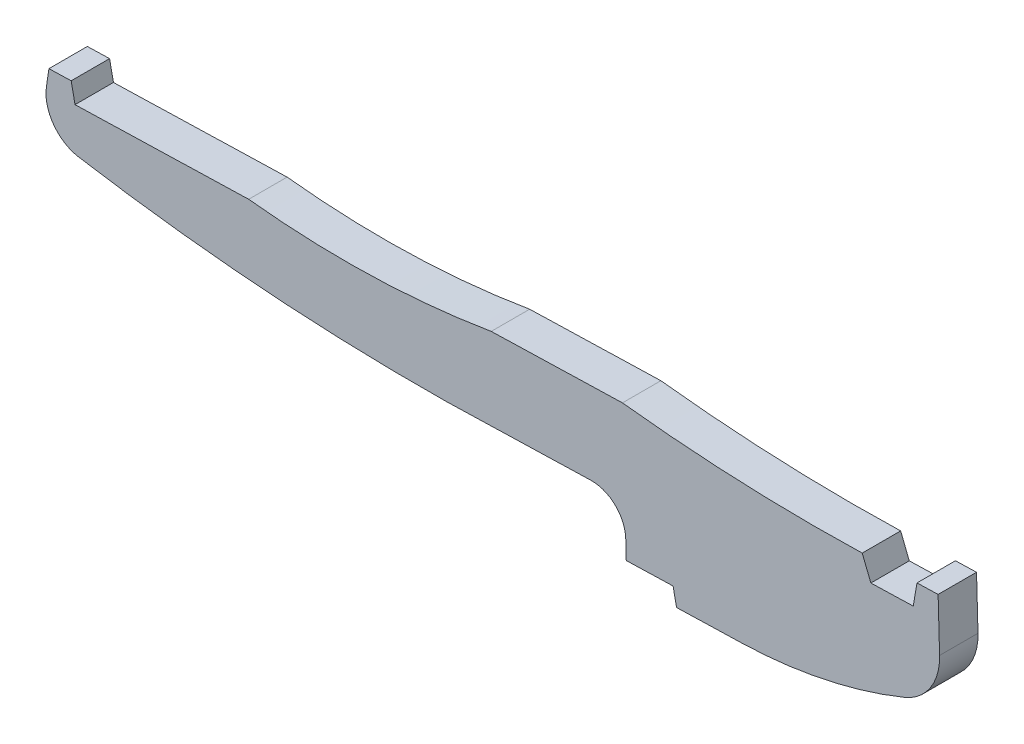
ISO-10303-21;
HEADER;
FILE_DESCRIPTION(('STEP AP214'),'2;1');
FILE_NAME('part.step','',(''),(''),'','','');
FILE_SCHEMA(('AUTOMOTIVE_DESIGN { 1 0 10303 214 1 1 1 1 }'));
ENDSEC;
DATA;
#1=APPLICATION_CONTEXT('core data for automotive mechanical design processes');
#2=APPLICATION_PROTOCOL_DEFINITION('international standard','automotive_design',2000,#1);
#3=PRODUCT_CONTEXT('',#1,'mechanical');
#4=PRODUCT('Part','Part','',(#3));
#5=PRODUCT_RELATED_PRODUCT_CATEGORY('part','',(#4));
#6=PRODUCT_DEFINITION_FORMATION('','',#4);
#7=PRODUCT_DEFINITION_CONTEXT('part definition',#1,'design');
#8=PRODUCT_DEFINITION('design','',#6,#7);
#9=PRODUCT_DEFINITION_SHAPE('','',#8);
#10=(LENGTH_UNIT() NAMED_UNIT(*) SI_UNIT(.MILLI.,.METRE.));
#11=(NAMED_UNIT(*) PLANE_ANGLE_UNIT() SI_UNIT($,.RADIAN.));
#12=(NAMED_UNIT(*) SI_UNIT($,.STERADIAN.) SOLID_ANGLE_UNIT());
#13=UNCERTAINTY_MEASURE_WITH_UNIT(LENGTH_MEASURE(1.E-05),#10,'distance_accuracy_value','');
#14=(GEOMETRIC_REPRESENTATION_CONTEXT(3) GLOBAL_UNCERTAINTY_ASSIGNED_CONTEXT((#13)) GLOBAL_UNIT_ASSIGNED_CONTEXT((#10,
#11,#12)) REPRESENTATION_CONTEXT('',''));
#15=CARTESIAN_POINT('',(0.,0.,0.));
#16=DIRECTION('',(0.,0.,1.));
#17=DIRECTION('',(1.,0.,0.));
#18=AXIS2_PLACEMENT_3D('',#15,#16,#17);
#19=CARTESIAN_POINT('',(-61.2898232129997,-19.2370589816528,6.8));
#20=DIRECTION('',(0.,0.,-1.));
#21=DIRECTION('',(-1.,0.,0.));
#22=AXIS2_PLACEMENT_3D('',#19,#20,#21);
#23=CYLINDRICAL_SURFACE('',#22,6.00000000000194);
#24=CARTESIAN_POINT('',(-61.2898232129997,-19.2370589816528,0.));
#25=DIRECTION('',(0.,0.,-1.));
#26=DIRECTION('',(1.,0.,0.));
#27=AXIS2_PLACEMENT_3D('',#24,#25,#26);
#28=CIRCLE('',#27,6.00000000000194);
#29=CARTESIAN_POINT('',(-61.45912368475,-13.239448011414,0.));
#30=VERTEX_POINT('',#29);
#31=CARTESIAN_POINT('',(-55.2922122427676,-19.0677585099014,0.));
#32=VERTEX_POINT('',#31);
#33=EDGE_CURVE('E272',#30,#32,#28,.T.);
#34=ORIENTED_EDGE('',*,*,#33,.T.);
#35=DIRECTION('',(0.,0.,-1.));
#36=VECTOR('',#35,1.);
#37=CARTESIAN_POINT('',(-55.2922122427676,-19.0677585099014,6.8));
#38=LINE('',#37,#36);
#39=CARTESIAN_POINT('',(-55.2922122427676,-19.0677585099014,6.8));
#40=VERTEX_POINT('',#39);
#41=EDGE_CURVE('E11',#40,#32,#38,.T.);
#42=ORIENTED_EDGE('',*,*,#41,.F.);
#43=CARTESIAN_POINT('',(-61.2898232129997,-19.2370589816528,6.8));
#44=DIRECTION('',(0.,0.,-1.));
#45=DIRECTION('',(1.,0.,0.));
#46=AXIS2_PLACEMENT_3D('',#43,#44,#45);
#47=CIRCLE('',#46,6.00000000000194);
#48=CARTESIAN_POINT('',(-61.45912368475,-13.239448011414,6.8));
#49=VERTEX_POINT('',#48);
#50=EDGE_CURVE('E334',#49,#40,#47,.T.);
#51=ORIENTED_EDGE('',*,*,#50,.F.);
#52=DIRECTION('',(0.,0.,-1.));
#53=VECTOR('',#52,1.);
#54=CARTESIAN_POINT('',(-61.45912368475,-13.239448011414,6.8));
#55=LINE('',#54,#53);
#56=EDGE_CURVE('E268',#49,#30,#55,.T.);
#57=ORIENTED_EDGE('',*,*,#56,.T.);
#58=EDGE_LOOP('',(#34,#42,#51,#57));
#59=FACE_BOUND('',#58,.T.);
#60=ADVANCED_FACE('F41',(#59),#23,.F.);
#61=CARTESIAN_POINT('',(-55.1978997779019,-22.4088565473677,6.8));
#62=DIRECTION('',(0.999601828372247,0.0282167452917683,0.));
#63=DIRECTION('',(-0.0282167452917683,0.999601828372247,0.));
#64=AXIS2_PLACEMENT_3D('',#61,#62,#63);
#65=PLANE('',#64);
#66=DIRECTION('',(0.0282167452917683,-0.999601828372247,0.));
#67=VECTOR('',#66,1.);
#68=CARTESIAN_POINT('',(-55.1978997779019,-22.4088565473677,0.));
#69=LINE('',#68,#67);
#70=CARTESIAN_POINT('',(-55.1978997779019,-22.4088565473677,0.));
#71=VERTEX_POINT('',#70);
#72=EDGE_CURVE('E276',#32,#71,#69,.T.);
#73=ORIENTED_EDGE('',*,*,#72,.T.);
#74=DIRECTION('',(0.,0.,-1.));
#75=VECTOR('',#74,1.);
#76=CARTESIAN_POINT('',(-55.1978997779019,-22.4088565473677,6.8));
#77=LINE('',#76,#75);
#78=CARTESIAN_POINT('',(-55.1978997779019,-22.4088565473677,6.8));
#79=VERTEX_POINT('',#78);
#80=EDGE_CURVE('E50',#79,#71,#77,.T.);
#81=ORIENTED_EDGE('',*,*,#80,.F.);
#82=DIRECTION('',(0.0282167452917683,-0.999601828372247,0.));
#83=VECTOR('',#82,1.);
#84=CARTESIAN_POINT('',(-55.1978997779019,-22.4088565473677,6.8));
#85=LINE('',#84,#83);
#86=EDGE_CURVE('E170',#40,#79,#85,.T.);
#87=ORIENTED_EDGE('',*,*,#86,.F.);
#88=ORIENTED_EDGE('',*,*,#41,.T.);
#89=EDGE_LOOP('',(#73,#81,#87,#88));
#90=FACE_BOUND('',#89,.T.);
#91=ADVANCED_FACE('F499',(#90),#65,.F.);
#92=CARTESIAN_POINT('',(-46.9099765247164,-22.1749051751369,6.8));
#93=DIRECTION('',(-0.0282167452916735,0.99960182837225,0.));
#94=DIRECTION('',(-0.99960182837225,-0.0282167452916735,0.));
#95=AXIS2_PLACEMENT_3D('',#92,#93,#94);
#96=PLANE('',#95);
#97=DIRECTION('',(0.99960182837225,0.0282167452916735,0.));
#98=VECTOR('',#97,1.);
#99=CARTESIAN_POINT('',(-46.9099765247164,-22.1749051751369,0.));
#100=LINE('',#99,#98);
#101=CARTESIAN_POINT('',(-46.9099765247164,-22.1749051751369,0.));
#102=VERTEX_POINT('',#101);
#103=EDGE_CURVE('E279',#71,#102,#100,.T.);
#104=ORIENTED_EDGE('',*,*,#103,.T.);
#105=DIRECTION('',(0.,0.,-1.));
#106=VECTOR('',#105,1.);
#107=CARTESIAN_POINT('',(-46.9099765247164,-22.1749051751369,6.8));
#108=LINE('',#107,#106);
#109=CARTESIAN_POINT('',(-46.9099765247164,-22.1749051751369,6.8));
#110=VERTEX_POINT('',#109);
#111=EDGE_CURVE('E401',#110,#102,#108,.T.);
#112=ORIENTED_EDGE('',*,*,#111,.F.);
#113=DIRECTION('',(0.99960182837225,0.0282167452916735,0.));
#114=VECTOR('',#113,1.);
#115=CARTESIAN_POINT('',(-46.9099765247164,-22.1749051751369,6.8));
#116=LINE('',#115,#114);
#117=EDGE_CURVE('E412',#79,#110,#116,.T.);
#118=ORIENTED_EDGE('',*,*,#117,.F.);
#119=ORIENTED_EDGE('',*,*,#80,.T.);
#120=EDGE_LOOP('',(#104,#112,#118,#119));
#121=FACE_BOUND('',#120,.T.);
#122=ADVANCED_FACE('F410',(#121),#96,.F.);
#123=CARTESIAN_POINT('',(-46.2965559719447,-25.1587845397603,6.8));
#124=DIRECTION('',(0.979515844108459,0.201367105408241,0.));
#125=DIRECTION('',(-0.201367105408241,0.979515844108459,0.));
#126=AXIS2_PLACEMENT_3D('',#123,#124,#125);
#127=PLANE('',#126);
#128=DIRECTION('',(0.201367105408241,-0.979515844108459,0.));
#129=VECTOR('',#128,1.);
#130=CARTESIAN_POINT('',(-46.2965559719447,-25.1587845397603,0.));
#131=LINE('',#130,#129);
#132=CARTESIAN_POINT('',(-46.2965559719447,-25.1587845397603,0.));
#133=VERTEX_POINT('',#132);
#134=EDGE_CURVE('E282',#102,#133,#131,.T.);
#135=ORIENTED_EDGE('',*,*,#134,.T.);
#136=DIRECTION('',(0.,0.,-1.));
#137=VECTOR('',#136,1.);
#138=CARTESIAN_POINT('',(-46.2965559719447,-25.1587845397603,6.8));
#139=LINE('',#138,#137);
#140=CARTESIAN_POINT('',(-46.2965559719447,-25.1587845397603,6.8));
#141=VERTEX_POINT('',#140);
#142=EDGE_CURVE('E397',#141,#133,#139,.T.);
#143=ORIENTED_EDGE('',*,*,#142,.F.);
#144=DIRECTION('',(0.201367105408241,-0.979515844108459,0.));
#145=VECTOR('',#144,1.);
#146=CARTESIAN_POINT('',(-46.2965559719447,-25.1587845397603,6.8));
#147=LINE('',#146,#145);
#148=EDGE_CURVE('E431',#110,#141,#147,.T.);
#149=ORIENTED_EDGE('',*,*,#148,.F.);
#150=ORIENTED_EDGE('',*,*,#111,.T.);
#151=EDGE_LOOP('',(#135,#143,#149,#150));
#152=FACE_BOUND('',#151,.T.);
#153=ADVANCED_FACE('F421',(#152),#127,.F.);
#154=CARTESIAN_POINT('',(-34.7870709910764,-24.8338949718227,6.8));
#155=DIRECTION('',(-0.0282167452904592,0.999601828372284,0.));
#156=DIRECTION('',(-0.999601828372284,-0.0282167452904592,0.));
#157=AXIS2_PLACEMENT_3D('',#154,#155,#156);
#158=PLANE('',#157);
#159=DIRECTION('',(0.999601828372284,0.0282167452904592,0.));
#160=VECTOR('',#159,1.);
#161=CARTESIAN_POINT('',(-34.7870709910764,-24.8338949718227,0.));
#162=LINE('',#161,#160);
#163=CARTESIAN_POINT('',(-34.7870709910764,-24.8338949718227,0.));
#164=VERTEX_POINT('',#163);
#165=EDGE_CURVE('E285',#133,#164,#162,.T.);
#166=ORIENTED_EDGE('',*,*,#165,.T.);
#167=DIRECTION('',(0.,0.,-1.));
#168=VECTOR('',#167,1.);
#169=CARTESIAN_POINT('',(-34.7870709910764,-24.8338949718227,6.8));
#170=LINE('',#169,#168);
#171=CARTESIAN_POINT('',(-34.7870709910764,-24.8338949718227,6.8));
#172=VERTEX_POINT('',#171);
#173=EDGE_CURVE('E393',#172,#164,#170,.T.);
#174=ORIENTED_EDGE('',*,*,#173,.F.);
#175=DIRECTION('',(0.999601828372284,0.0282167452904592,0.));
#176=VECTOR('',#175,1.);
#177=CARTESIAN_POINT('',(-34.7870709910764,-24.8338949718227,6.8));
#178=LINE('',#177,#176);
#179=EDGE_CURVE('E427',#141,#172,#178,.T.);
#180=ORIENTED_EDGE('',*,*,#179,.F.);
#181=ORIENTED_EDGE('',*,*,#142,.T.);
#182=EDGE_LOOP('',(#166,#174,#180,#181));
#183=FACE_BOUND('',#182,.T.);
#184=ADVANCED_FACE('F425',(#183),#158,.F.);
#185=CARTESIAN_POINT('',(-37.1187463873878,57.7676583021074,6.8));
#186=DIRECTION('',(0.,0.,-1.));
#187=DIRECTION('',(-1.,0.,0.));
#188=AXIS2_PLACEMENT_3D('',#185,#186,#187);
#189=CYLINDRICAL_SURFACE('',#188,82.6344559697685);
#190=CARTESIAN_POINT('',(-37.1187463873878,57.7676583021074,0.));
#191=DIRECTION('',(0.,0.,1.));
#192=DIRECTION('',(1.,0.,0.));
#193=AXIS2_PLACEMENT_3D('',#190,#191,#192);
#194=CIRCLE('',#193,82.6344559697685);
#195=CARTESIAN_POINT('',(-5.9656170288609,-18.7694950587962,0.));
#196=VERTEX_POINT('',#195);
#197=EDGE_CURVE('E288',#164,#196,#194,.T.);
#198=ORIENTED_EDGE('',*,*,#197,.T.);
#199=DIRECTION('',(0.,0.,-1.));
#200=VECTOR('',#199,1.);
#201=CARTESIAN_POINT('',(-5.9656170288609,-18.7694950587962,6.8));
#202=LINE('',#201,#200);
#203=CARTESIAN_POINT('',(-5.9656170288609,-18.7694950587962,6.8));
#204=VERTEX_POINT('',#203);
#205=EDGE_CURVE('E389',#204,#196,#202,.T.);
#206=ORIENTED_EDGE('',*,*,#205,.F.);
#207=CARTESIAN_POINT('',(-37.1187463873878,57.7676583021074,6.8));
#208=DIRECTION('',(0.,0.,1.));
#209=DIRECTION('',(1.,0.,0.));
#210=AXIS2_PLACEMENT_3D('',#207,#208,#209);
#211=CIRCLE('',#210,82.6344559697685);
#212=EDGE_CURVE('E430',#172,#204,#211,.T.);
#213=ORIENTED_EDGE('',*,*,#212,.F.);
#214=ORIENTED_EDGE('',*,*,#173,.T.);
#215=EDGE_LOOP('',(#198,#206,#213,#214));
#216=FACE_BOUND('',#215,.T.);
#217=ADVANCED_FACE('F512',(#216),#189,.T.);
#218=CARTESIAN_POINT('',(-9.73560970236277,-9.50735949287031,6.8));
#219=DIRECTION('',(0.,0.,-1.));
#220=DIRECTION('',(-1.,0.,0.));
#221=AXIS2_PLACEMENT_3D('',#218,#219,#220);
#222=CYLINDRICAL_SURFACE('',#221,9.99999999999226);
#223=CARTESIAN_POINT('',(-9.73560970236277,-9.50735949287031,0.));
#224=DIRECTION('',(0.,0.,1.));
#225=DIRECTION('',(1.,0.,0.));
#226=AXIS2_PLACEMENT_3D('',#223,#224,#225);
#227=CIRCLE('',#226,9.99999999999226);
#228=CARTESIAN_POINT('',(0.260408581352329,-9.22519203996589,0.));
#229=VERTEX_POINT('',#228);
#230=EDGE_CURVE('E291',#196,#229,#227,.T.);
#231=ORIENTED_EDGE('',*,*,#230,.T.);
#232=DIRECTION('',(0.,0.,-1.));
#233=VECTOR('',#232,1.);
#234=CARTESIAN_POINT('',(0.260408581352329,-9.22519203996589,6.8));
#235=LINE('',#234,#233);
#236=CARTESIAN_POINT('',(0.260408581352329,-9.22519203996589,6.8));
#237=VERTEX_POINT('',#236);
#238=EDGE_CURVE('E385',#237,#229,#235,.T.);
#239=ORIENTED_EDGE('',*,*,#238,.F.);
#240=CARTESIAN_POINT('',(-9.73560970236277,-9.50735949287031,6.8));
#241=DIRECTION('',(0.,0.,1.));
#242=DIRECTION('',(1.,0.,0.));
#243=AXIS2_PLACEMENT_3D('',#240,#241,#242);
#244=CIRCLE('',#243,9.99999999999226);
#245=EDGE_CURVE('E434',#204,#237,#244,.T.);
#246=ORIENTED_EDGE('',*,*,#245,.F.);
#247=ORIENTED_EDGE('',*,*,#205,.T.);
#248=EDGE_LOOP('',(#231,#239,#246,#247));
#249=FACE_BOUND('',#248,.T.);
#250=ADVANCED_FACE('F515',(#249),#222,.T.);
#251=CARTESIAN_POINT('',(-2.62133062974744E-13,0.,6.8));
#252=DIRECTION('',(-0.999601828372293,-0.0282167452901265,0.));
#253=DIRECTION('',(0.0282167452901266,-0.999601828372294,0.));
#254=AXIS2_PLACEMENT_3D('',#251,#252,#253);
#255=PLANE('',#254);
#256=DIRECTION('',(-0.0282167452901266,0.999601828372293,0.));
#257=VECTOR('',#256,1.);
#258=CARTESIAN_POINT('',(-2.62133062974744E-13,0.,0.));
#259=LINE('',#258,#257);
#260=CARTESIAN_POINT('',(-2.62133062974744E-13,0.,0.));
#261=VERTEX_POINT('',#260);
#262=EDGE_CURVE('E294',#229,#261,#259,.T.);
#263=ORIENTED_EDGE('',*,*,#262,.T.);
#264=DIRECTION('',(0.,0.,-1.));
#265=VECTOR('',#264,1.);
#266=CARTESIAN_POINT('',(-2.62133062974744E-13,0.,6.8));
#267=LINE('',#266,#265);
#268=CARTESIAN_POINT('',(-2.62133062974744E-13,0.,6.8));
#269=VERTEX_POINT('',#268);
#270=EDGE_CURVE('E381',#269,#261,#267,.T.);
#271=ORIENTED_EDGE('',*,*,#270,.F.);
#272=DIRECTION('',(-0.0282167452901266,0.999601828372293,0.));
#273=VECTOR('',#272,1.);
#274=CARTESIAN_POINT('',(-2.62133062974744E-13,0.,6.8));
#275=LINE('',#274,#273);
#276=EDGE_CURVE('E442',#237,#269,#275,.T.);
#277=ORIENTED_EDGE('',*,*,#276,.F.);
#278=ORIENTED_EDGE('',*,*,#238,.T.);
#279=EDGE_LOOP('',(#263,#271,#277,#278));
#280=FACE_BOUND('',#279,.T.);
#281=ADVANCED_FACE('F519',(#280),#255,.F.);
#282=CARTESIAN_POINT('',(-3.73655335163197,-0.105475371486204,6.8));
#283=DIRECTION('',(0.0282167452900974,-0.999601828372294,0.));
#284=DIRECTION('',(0.999601828372294,0.0282167452900974,0.));
#285=AXIS2_PLACEMENT_3D('',#282,#283,#284);
#286=PLANE('',#285);
#287=DIRECTION('',(-0.999601828372294,-0.0282167452900974,0.));
#288=VECTOR('',#287,1.);
#289=CARTESIAN_POINT('',(-3.73655335163197,-0.105475371486204,0.));
#290=LINE('',#289,#288);
#291=CARTESIAN_POINT('',(-3.73655335163197,-0.105475371486204,0.));
#292=VERTEX_POINT('',#291);
#293=EDGE_CURVE('E297',#261,#292,#290,.T.);
#294=ORIENTED_EDGE('',*,*,#293,.T.);
#295=DIRECTION('',(0.,0.,-1.));
#296=VECTOR('',#295,1.);
#297=CARTESIAN_POINT('',(-3.73655335163197,-0.105475371486204,6.8));
#298=LINE('',#297,#296);
#299=CARTESIAN_POINT('',(-3.73655335163197,-0.105475371486204,6.8));
#300=VERTEX_POINT('',#299);
#301=EDGE_CURVE('E377',#300,#292,#298,.T.);
#302=ORIENTED_EDGE('',*,*,#301,.F.);
#303=DIRECTION('',(-0.999601828372294,-0.0282167452900974,0.));
#304=VECTOR('',#303,1.);
#305=CARTESIAN_POINT('',(-3.73655335163197,-0.105475371486204,6.8));
#306=LINE('',#305,#304);
#307=EDGE_CURVE('E445',#269,#300,#306,.T.);
#308=ORIENTED_EDGE('',*,*,#307,.F.);
#309=ORIENTED_EDGE('',*,*,#270,.T.);
#310=EDGE_LOOP('',(#294,#302,#308,#309));
#311=FACE_BOUND('',#310,.T.);
#312=ADVANCED_FACE('F523',(#311),#286,.F.);
#313=CARTESIAN_POINT('',(-4.4060557155227,-3.99410363196135,6.8));
#314=DIRECTION('',(0.98550043322748,-0.169672909176593,0.));
#315=DIRECTION('',(0.169672909176593,0.985500433227481,0.));
#316=AXIS2_PLACEMENT_3D('',#313,#314,#315);
#317=PLANE('',#316);
#318=DIRECTION('',(-0.169672909176593,-0.98550043322748,0.));
#319=VECTOR('',#318,1.);
#320=CARTESIAN_POINT('',(-4.4060557155227,-3.99410363196135,0.));
#321=LINE('',#320,#319);
#322=CARTESIAN_POINT('',(-4.4060557155227,-3.99410363196135,0.));
#323=VERTEX_POINT('',#322);
#324=EDGE_CURVE('E300',#292,#323,#321,.T.);
#325=ORIENTED_EDGE('',*,*,#324,.T.);
#326=DIRECTION('',(0.,0.,-1.));
#327=VECTOR('',#326,1.);
#328=CARTESIAN_POINT('',(-4.4060557155227,-3.99410363196135,6.8));
#329=LINE('',#328,#327);
#330=CARTESIAN_POINT('',(-4.4060557155227,-3.99410363196135,6.8));
#331=VERTEX_POINT('',#330);
#332=EDGE_CURVE('E373',#331,#323,#329,.T.);
#333=ORIENTED_EDGE('',*,*,#332,.F.);
#334=DIRECTION('',(-0.169672909176593,-0.98550043322748,0.));
#335=VECTOR('',#334,1.);
#336=CARTESIAN_POINT('',(-4.4060557155227,-3.99410363196135,6.8));
#337=LINE('',#336,#335);
#338=EDGE_CURVE('E448',#300,#331,#337,.T.);
#339=ORIENTED_EDGE('',*,*,#338,.F.);
#340=ORIENTED_EDGE('',*,*,#301,.T.);
#341=EDGE_LOOP('',(#325,#333,#339,#340));
#342=FACE_BOUND('',#341,.T.);
#343=ADVANCED_FACE('F527',(#342),#317,.F.);
#344=CARTESIAN_POINT('',(-11.9030694284909,-4.20572922157118,6.8));
#345=DIRECTION('',(0.0282167452806554,-0.999601828372561,0.));
#346=DIRECTION('',(0.999601828372561,0.0282167452806554,0.));
#347=AXIS2_PLACEMENT_3D('',#344,#345,#346);
#348=PLANE('',#347);
#349=DIRECTION('',(-0.999601828372561,-0.0282167452806554,0.));
#350=VECTOR('',#349,1.);
#351=CARTESIAN_POINT('',(-11.9030694284909,-4.20572922157118,0.));
#352=LINE('',#351,#350);
#353=CARTESIAN_POINT('',(-11.9030694284909,-4.20572922157118,0.));
#354=VERTEX_POINT('',#353);
#355=EDGE_CURVE('E303',#323,#354,#352,.T.);
#356=ORIENTED_EDGE('',*,*,#355,.T.);
#357=DIRECTION('',(0.,0.,-1.));
#358=VECTOR('',#357,1.);
#359=CARTESIAN_POINT('',(-11.9030694284909,-4.20572922157118,6.8));
#360=LINE('',#359,#358);
#361=CARTESIAN_POINT('',(-11.9030694284909,-4.20572922157118,6.8));
#362=VERTEX_POINT('',#361);
#363=EDGE_CURVE('E369',#362,#354,#360,.T.);
#364=ORIENTED_EDGE('',*,*,#363,.F.);
#365=DIRECTION('',(-0.999601828372561,-0.0282167452806554,0.));
#366=VECTOR('',#365,1.);
#367=CARTESIAN_POINT('',(-11.9030694284909,-4.20572922157118,6.8));
#368=LINE('',#367,#366);
#369=EDGE_CURVE('E451',#331,#362,#368,.T.);
#370=ORIENTED_EDGE('',*,*,#369,.F.);
#371=ORIENTED_EDGE('',*,*,#332,.T.);
#372=EDGE_LOOP('',(#356,#364,#370,#371));
#373=FACE_BOUND('',#372,.T.);
#374=ADVANCED_FACE('F531',(#373),#348,.F.);
#375=CARTESIAN_POINT('',(-13.4323106293656,-0.379167061252225,6.8));
#376=DIRECTION('',(-0.928592429824842,-0.371101198154891,0.));
#377=DIRECTION('',(0.371101198154891,-0.928592429824842,0.));
#378=AXIS2_PLACEMENT_3D('',#375,#376,#377);
#379=PLANE('',#378);
#380=DIRECTION('',(-0.371101198154891,0.928592429824842,0.));
#381=VECTOR('',#380,1.);
#382=CARTESIAN_POINT('',(-13.4323106293656,-0.379167061252225,0.));
#383=LINE('',#382,#381);
#384=CARTESIAN_POINT('',(-13.4323106293656,-0.379167061252225,0.));
#385=VERTEX_POINT('',#384);
#386=EDGE_CURVE('E306',#354,#385,#383,.T.);
#387=ORIENTED_EDGE('',*,*,#386,.T.);
#388=DIRECTION('',(0.,0.,-1.));
#389=VECTOR('',#388,1.);
#390=CARTESIAN_POINT('',(-13.4323106293656,-0.379167061252225,6.8));
#391=LINE('',#390,#389);
#392=CARTESIAN_POINT('',(-13.4323106293656,-0.379167061252225,6.8));
#393=VERTEX_POINT('',#392);
#394=EDGE_CURVE('E365',#393,#385,#391,.T.);
#395=ORIENTED_EDGE('',*,*,#394,.F.);
#396=DIRECTION('',(-0.371101198154891,0.928592429824842,0.));
#397=VECTOR('',#396,1.);
#398=CARTESIAN_POINT('',(-13.4323106293656,-0.379167061252225,6.8));
#399=LINE('',#398,#397);
#400=EDGE_CURVE('E454',#362,#393,#399,.T.);
#401=ORIENTED_EDGE('',*,*,#400,.F.);
#402=ORIENTED_EDGE('',*,*,#363,.T.);
#403=EDGE_LOOP('',(#387,#395,#401,#402));
#404=FACE_BOUND('',#403,.T.);
#405=ADVANCED_FACE('F535',(#404),#379,.F.);
#406=CARTESIAN_POINT('',(-21.9173907409701,300.211900627323,6.8));
#407=DIRECTION('',(0.,0.,-1.));
#408=DIRECTION('',(-1.,0.,0.));
#409=AXIS2_PLACEMENT_3D('',#406,#407,#408);
#410=CYLINDRICAL_SURFACE('',#409,300.710802198155);
#411=CARTESIAN_POINT('',(-21.9173907409701,300.211900627323,0.));
#412=DIRECTION('',(0.,0.,-1.));
#413=DIRECTION('',(1.,0.,0.));
#414=AXIS2_PLACEMENT_3D('',#411,#412,#413);
#415=CIRCLE('',#414,300.710802198155);
#416=CARTESIAN_POINT('',(-55.8706555212621,1.4240789721936,0.));
#417=VERTEX_POINT('',#416);
#418=EDGE_CURVE('E309',#385,#417,#415,.T.);
#419=ORIENTED_EDGE('',*,*,#418,.T.);
#420=DIRECTION('',(0.,0.,-1.));
#421=VECTOR('',#420,1.);
#422=CARTESIAN_POINT('',(-55.8706555212621,1.4240789721936,6.8));
#423=LINE('',#422,#421);
#424=CARTESIAN_POINT('',(-55.8706555212621,1.4240789721936,6.8));
#425=VERTEX_POINT('',#424);
#426=EDGE_CURVE('E361',#425,#417,#423,.T.);
#427=ORIENTED_EDGE('',*,*,#426,.F.);
#428=CARTESIAN_POINT('',(-21.9173907409701,300.211900627323,6.8));
#429=DIRECTION('',(0.,0.,-1.));
#430=DIRECTION('',(1.,0.,0.));
#431=AXIS2_PLACEMENT_3D('',#428,#429,#430);
#432=CIRCLE('',#431,300.710802198155);
#433=EDGE_CURVE('E457',#393,#425,#432,.T.);
#434=ORIENTED_EDGE('',*,*,#433,.F.);
#435=ORIENTED_EDGE('',*,*,#394,.T.);
#436=EDGE_LOOP('',(#419,#427,#434,#435));
#437=FACE_BOUND('',#436,.T.);
#438=ADVANCED_FACE('F539',(#437),#410,.F.);
#439=CARTESIAN_POINT('',(-79.0982507347868,0.768410765967434,6.8));
#440=DIRECTION('',(0.0282167452861209,-0.999601828372407,0.));
#441=DIRECTION('',(0.999601828372407,0.0282167452861209,0.));
#442=AXIS2_PLACEMENT_3D('',#439,#440,#441);
#443=PLANE('',#442);
#444=DIRECTION('',(-0.999601828372407,-0.0282167452861209,0.));
#445=VECTOR('',#444,1.);
#446=CARTESIAN_POINT('',(-79.0982507347868,0.768410765967434,0.));
#447=LINE('',#446,#445);
#448=CARTESIAN_POINT('',(-79.0982507347868,0.768410765967434,0.));
#449=VERTEX_POINT('',#448);
#450=EDGE_CURVE('E312',#417,#449,#447,.T.);
#451=ORIENTED_EDGE('',*,*,#450,.T.);
#452=DIRECTION('',(0.,0.,-1.));
#453=VECTOR('',#452,1.);
#454=CARTESIAN_POINT('',(-79.0982507347868,0.768410765967434,6.8));
#455=LINE('',#454,#453);
#456=CARTESIAN_POINT('',(-79.0982507347868,0.768410765967434,6.8));
#457=VERTEX_POINT('',#456);
#458=EDGE_CURVE('E357',#457,#449,#455,.T.);
#459=ORIENTED_EDGE('',*,*,#458,.F.);
#460=DIRECTION('',(-0.999601828372407,-0.0282167452861209,0.));
#461=VECTOR('',#460,1.);
#462=CARTESIAN_POINT('',(-79.0982507347868,0.768410765967434,6.8));
#463=LINE('',#462,#461);
#464=EDGE_CURVE('E460',#425,#457,#463,.T.);
#465=ORIENTED_EDGE('',*,*,#464,.F.);
#466=ORIENTED_EDGE('',*,*,#426,.T.);
#467=EDGE_LOOP('',(#451,#459,#465,#466));
#468=FACE_BOUND('',#467,.T.);
#469=ADVANCED_FACE('F543',(#468),#443,.F.);
#470=CARTESIAN_POINT('',(-104.91462496914,154.316203359426,6.8));
#471=DIRECTION('',(0.,0.,-1.));
#472=DIRECTION('',(-1.,0.,0.));
#473=AXIS2_PLACEMENT_3D('',#470,#471,#472);
#474=CYLINDRICAL_SURFACE('',#473,155.702953693666);
#475=CARTESIAN_POINT('',(-104.91462496914,154.316203359426,0.));
#476=DIRECTION('',(0.,0.,-1.));
#477=DIRECTION('',(1.,0.,0.));
#478=AXIS2_PLACEMENT_3D('',#475,#476,#477);
#479=CIRCLE('',#478,155.702953693666);
#480=CARTESIAN_POINT('',(-122.028102344561,-0.443412435693097,0.));
#481=VERTEX_POINT('',#480);
#482=EDGE_CURVE('E315',#449,#481,#479,.T.);
#483=ORIENTED_EDGE('',*,*,#482,.T.);
#484=DIRECTION('',(0.,0.,-1.));
#485=VECTOR('',#484,1.);
#486=CARTESIAN_POINT('',(-122.028102344561,-0.443412435693097,6.8));
#487=LINE('',#486,#485);
#488=CARTESIAN_POINT('',(-122.028102344561,-0.443412435693097,6.8));
#489=VERTEX_POINT('',#488);
#490=EDGE_CURVE('E353',#489,#481,#487,.T.);
#491=ORIENTED_EDGE('',*,*,#490,.F.);
#492=CARTESIAN_POINT('',(-104.91462496914,154.316203359426,6.8));
#493=DIRECTION('',(0.,0.,-1.));
#494=DIRECTION('',(1.,0.,0.));
#495=AXIS2_PLACEMENT_3D('',#492,#493,#494);
#496=CIRCLE('',#495,155.702953693666);
#497=EDGE_CURVE('E463',#457,#489,#496,.T.);
#498=ORIENTED_EDGE('',*,*,#497,.F.);
#499=ORIENTED_EDGE('',*,*,#458,.T.);
#500=EDGE_LOOP('',(#483,#491,#498,#499));
#501=FACE_BOUND('',#500,.T.);
#502=ADVANCED_FACE('F547',(#501),#474,.F.);
#503=CARTESIAN_POINT('',(-152.767576006945,-1.31112583310975,6.8));
#504=DIRECTION('',(0.0282167452861209,-0.999601828372407,0.));
#505=DIRECTION('',(0.999601828372407,0.0282167452861209,0.));
#506=AXIS2_PLACEMENT_3D('',#503,#504,#505);
#507=PLANE('',#506);
#508=DIRECTION('',(-0.999601828372407,-0.0282167452861209,0.));
#509=VECTOR('',#508,1.);
#510=CARTESIAN_POINT('',(-152.767576006945,-1.31112583310975,0.));
#511=LINE('',#510,#509);
#512=CARTESIAN_POINT('',(-152.767576006945,-1.31112583310975,0.));
#513=VERTEX_POINT('',#512);
#514=EDGE_CURVE('E318',#481,#513,#511,.T.);
#515=ORIENTED_EDGE('',*,*,#514,.T.);
#516=DIRECTION('',(0.,0.,-1.));
#517=VECTOR('',#516,1.);
#518=CARTESIAN_POINT('',(-152.767576006945,-1.31112583310975,6.8));
#519=LINE('',#518,#517);
#520=CARTESIAN_POINT('',(-152.767576006945,-1.31112583310975,6.8));
#521=VERTEX_POINT('',#520);
#522=EDGE_CURVE('E349',#521,#513,#519,.T.);
#523=ORIENTED_EDGE('',*,*,#522,.F.);
#524=DIRECTION('',(-0.999601828372407,-0.0282167452861209,0.));
#525=VECTOR('',#524,1.);
#526=CARTESIAN_POINT('',(-152.767576006945,-1.31112583310975,6.8));
#527=LINE('',#526,#525);
#528=EDGE_CURVE('E466',#489,#521,#527,.T.);
#529=ORIENTED_EDGE('',*,*,#528,.F.);
#530=ORIENTED_EDGE('',*,*,#490,.T.);
#531=EDGE_LOOP('',(#515,#523,#529,#530));
#532=FACE_BOUND('',#531,.T.);
#533=ADVANCED_FACE('F551',(#532),#507,.F.);
#534=CARTESIAN_POINT('',(-153.450231486003,2.0095349875542,6.8));
#535=DIRECTION('',(-0.979515844090378,-0.201367105496191,0.));
#536=DIRECTION('',(0.201367105496191,-0.979515844090378,0.));
#537=AXIS2_PLACEMENT_3D('',#534,#535,#536);
#538=PLANE('',#537);
#539=DIRECTION('',(-0.201367105496191,0.979515844090378,0.));
#540=VECTOR('',#539,1.);
#541=CARTESIAN_POINT('',(-153.450231486003,2.0095349875542,0.));
#542=LINE('',#541,#540);
#543=CARTESIAN_POINT('',(-153.450231486003,2.0095349875542,0.));
#544=VERTEX_POINT('',#543);
#545=EDGE_CURVE('E321',#513,#544,#542,.T.);
#546=ORIENTED_EDGE('',*,*,#545,.T.);
#547=DIRECTION('',(0.,0.,-1.));
#548=VECTOR('',#547,1.);
#549=CARTESIAN_POINT('',(-153.450231486003,2.0095349875542,6.8));
#550=LINE('',#549,#548);
#551=CARTESIAN_POINT('',(-153.450231486003,2.0095349875542,6.8));
#552=VERTEX_POINT('',#551);
#553=EDGE_CURVE('E345',#552,#544,#550,.T.);
#554=ORIENTED_EDGE('',*,*,#553,.F.);
#555=DIRECTION('',(-0.201367105496191,0.979515844090378,0.));
#556=VECTOR('',#555,1.);
#557=CARTESIAN_POINT('',(-153.450231486003,2.0095349875542,6.8));
#558=LINE('',#557,#556);
#559=EDGE_CURVE('E469',#521,#552,#558,.T.);
#560=ORIENTED_EDGE('',*,*,#559,.F.);
#561=ORIENTED_EDGE('',*,*,#522,.T.);
#562=EDGE_LOOP('',(#546,#554,#560,#561));
#563=FACE_BOUND('',#562,.T.);
#564=ADVANCED_FACE('F555',(#563),#538,.F.);
#565=CARTESIAN_POINT('',(-157.390699993582,1.89830350129465,6.8));
#566=DIRECTION('',(0.0282167455019818,-0.999601828366313,0.));
#567=DIRECTION('',(0.999601828366313,0.0282167455019818,0.));
#568=AXIS2_PLACEMENT_3D('',#565,#566,#567);
#569=PLANE('',#568);
#570=DIRECTION('',(-0.999601828366313,-0.0282167455019818,0.));
#571=VECTOR('',#570,1.);
#572=CARTESIAN_POINT('',(-157.390699993582,1.89830350129465,0.));
#573=LINE('',#572,#571);
#574=CARTESIAN_POINT('',(-157.390699993582,1.89830350129465,0.));
#575=VERTEX_POINT('',#574);
#576=EDGE_CURVE('E324',#544,#575,#573,.T.);
#577=ORIENTED_EDGE('',*,*,#576,.T.);
#578=DIRECTION('',(0.,0.,-1.));
#579=VECTOR('',#578,1.);
#580=CARTESIAN_POINT('',(-157.390699993582,1.89830350129465,6.8));
#581=LINE('',#580,#579);
#582=CARTESIAN_POINT('',(-157.390699993582,1.89830350129465,6.8));
#583=VERTEX_POINT('',#582);
#584=EDGE_CURVE('E341',#583,#575,#581,.T.);
#585=ORIENTED_EDGE('',*,*,#584,.F.);
#586=DIRECTION('',(-0.999601828366313,-0.0282167455019818,0.));
#587=VECTOR('',#586,1.);
#588=CARTESIAN_POINT('',(-157.390699993582,1.89830350129465,6.8));
#589=LINE('',#588,#587);
#590=EDGE_CURVE('E472',#552,#583,#589,.T.);
#591=ORIENTED_EDGE('',*,*,#590,.F.);
#592=ORIENTED_EDGE('',*,*,#553,.T.);
#593=EDGE_LOOP('',(#577,#585,#591,#592));
#594=FACE_BOUND('',#593,.T.);
#595=ADVANCED_FACE('F480',(#594),#569,.F.);
#596=CARTESIAN_POINT('',(-157.834820074705,-1.11542810432885,6.8));
#597=DIRECTION('',(0.989315416902209,-0.14579096638547,0.));
#598=DIRECTION('',(0.14579096638547,0.989315416902209,0.));
#599=AXIS2_PLACEMENT_3D('',#596,#597,#598);
#600=PLANE('',#599);
#601=DIRECTION('',(-0.14579096638547,-0.989315416902209,0.));
#602=VECTOR('',#601,1.);
#603=CARTESIAN_POINT('',(-157.834820074705,-1.11542810432885,0.));
#604=LINE('',#603,#602);
#605=CARTESIAN_POINT('',(-157.834820074705,-1.11542810432885,0.));
#606=VERTEX_POINT('',#605);
#607=EDGE_CURVE('E327',#575,#606,#604,.T.);
#608=ORIENTED_EDGE('',*,*,#607,.T.);
#609=DIRECTION('',(0.,0.,-1.));
#610=VECTOR('',#609,1.);
#611=CARTESIAN_POINT('',(-157.834820074705,-1.11542810432885,6.8));
#612=LINE('',#611,#610);
#613=CARTESIAN_POINT('',(-157.834820074705,-1.11542810432885,6.8));
#614=VERTEX_POINT('',#613);
#615=EDGE_CURVE('E259',#614,#606,#612,.T.);
#616=ORIENTED_EDGE('',*,*,#615,.F.);
#617=DIRECTION('',(-0.14579096638547,-0.989315416902209,0.));
#618=VECTOR('',#617,1.);
#619=CARTESIAN_POINT('',(-157.834820074705,-1.11542810432885,6.8));
#620=LINE('',#619,#618);
#621=EDGE_CURVE('E248',#583,#614,#620,.T.);
#622=ORIENTED_EDGE('',*,*,#621,.F.);
#623=ORIENTED_EDGE('',*,*,#584,.T.);
#624=EDGE_LOOP('',(#608,#616,#622,#623));
#625=FACE_BOUND('',#624,.T.);
#626=ADVANCED_FACE('F484',(#625),#600,.F.);
#627=CARTESIAN_POINT('',(-150.909612156395,-2.13596486902597,6.8));
#628=DIRECTION('',(0.,0.,-1.));
#629=DIRECTION('',(-1.,0.,0.));
#630=AXIS2_PLACEMENT_3D('',#627,#628,#629);
#631=CYLINDRICAL_SURFACE('',#630,6.99999999999081);
#632=CARTESIAN_POINT('',(-150.909612156395,-2.13596486902597,0.));
#633=DIRECTION('',(0.,0.,1.));
#634=DIRECTION('',(1.,0.,0.));
#635=AXIS2_PLACEMENT_3D('',#632,#633,#634);
#636=CIRCLE('',#635,6.99999999999081);
#637=CARTESIAN_POINT('',(-152.397282865835,-8.97605520908331,0.));
#638=VERTEX_POINT('',#637);
#639=EDGE_CURVE('E257',#606,#638,#636,.T.);
#640=ORIENTED_EDGE('',*,*,#639,.T.);
#641=DIRECTION('',(0.,0.,-1.));
#642=VECTOR('',#641,1.);
#643=CARTESIAN_POINT('',(-152.397282865835,-8.97605520908331,6.8));
#644=LINE('',#643,#642);
#645=CARTESIAN_POINT('',(-152.397282865835,-8.97605520908331,6.8));
#646=VERTEX_POINT('',#645);
#647=EDGE_CURVE('E254',#646,#638,#644,.T.);
#648=ORIENTED_EDGE('',*,*,#647,.F.);
#649=CARTESIAN_POINT('',(-150.909612156395,-2.13596486902597,6.8));
#650=DIRECTION('',(0.,0.,1.));
#651=DIRECTION('',(1.,0.,0.));
#652=AXIS2_PLACEMENT_3D('',#649,#650,#651);
#653=CIRCLE('',#652,6.99999999999081);
#654=EDGE_CURVE('E242',#614,#646,#653,.T.);
#655=ORIENTED_EDGE('',*,*,#654,.F.);
#656=ORIENTED_EDGE('',*,*,#615,.T.);
#657=EDGE_LOOP('',(#640,#648,#655,#656));
#658=FACE_BOUND('',#657,.T.);
#659=ADVANCED_FACE('F255',(#658),#631,.T.);
#660=CARTESIAN_POINT('',(-91.4577880823773,359.123139639301,6.8));
#661=DIRECTION('',(0.,0.,-1.));
#662=DIRECTION('',(-1.,0.,0.));
#663=AXIS2_PLACEMENT_3D('',#660,#661,#662);
#664=CYLINDRICAL_SURFACE('',#663,373.109419972867);
#665=CARTESIAN_POINT('',(-91.4577880823773,359.123139639301,0.));
#666=DIRECTION('',(0.,0.,1.));
#667=DIRECTION('',(1.,0.,0.));
#668=AXIS2_PLACEMENT_3D('',#665,#666,#667);
#669=CIRCLE('',#668,373.109419972867);
#670=CARTESIAN_POINT('',(-86.9527514832853,-13.9590817512796,0.));
#671=VERTEX_POINT('',#670);
#672=EDGE_CURVE('E154',#638,#671,#669,.T.);
#673=ORIENTED_EDGE('',*,*,#672,.T.);
#674=DIRECTION('',(0.,0.,-1.));
#675=VECTOR('',#674,1.);
#676=CARTESIAN_POINT('',(-86.9527514832853,-13.9590817512796,6.8));
#677=LINE('',#676,#675);
#678=CARTESIAN_POINT('',(-86.9527514832853,-13.9590817512796,6.8));
#679=VERTEX_POINT('',#678);
#680=EDGE_CURVE('E260',#679,#671,#677,.T.);
#681=ORIENTED_EDGE('',*,*,#680,.F.);
#682=CARTESIAN_POINT('',(-91.4577880823773,359.123139639301,6.8));
#683=DIRECTION('',(0.,0.,1.));
#684=DIRECTION('',(1.,0.,0.));
#685=AXIS2_PLACEMENT_3D('',#682,#683,#684);
#686=CIRCLE('',#685,373.109419972867);
#687=EDGE_CURVE('E246',#646,#679,#686,.T.);
#688=ORIENTED_EDGE('',*,*,#687,.F.);
#689=ORIENTED_EDGE('',*,*,#647,.T.);
#690=EDGE_LOOP('',(#673,#681,#688,#689));
#691=FACE_BOUND('',#690,.T.);
#692=ADVANCED_FACE('F262',(#691),#664,.T.);
#693=CARTESIAN_POINT('',(-61.45912368475,-13.239448011414,6.8));
#694=DIRECTION('',(-0.0282167452907311,0.999601828372276,0.));
#695=DIRECTION('',(-0.999601828372276,-0.0282167452907311,0.));
#696=AXIS2_PLACEMENT_3D('',#693,#694,#695);
#697=PLANE('',#696);
#698=DIRECTION('',(0.999601828372277,0.0282167452907311,0.));
#699=VECTOR('',#698,1.);
#700=CARTESIAN_POINT('',(-61.45912368475,-13.239448011414,0.));
#701=LINE('',#700,#699);
#702=EDGE_CURVE('E160',#671,#30,#701,.T.);
#703=ORIENTED_EDGE('',*,*,#702,.T.);
#704=ORIENTED_EDGE('',*,*,#56,.F.);
#705=DIRECTION('',(0.999601828372277,0.0282167452907311,0.));
#706=VECTOR('',#705,1.);
#707=CARTESIAN_POINT('',(-61.45912368475,-13.239448011414,6.8));
#708=LINE('',#707,#706);
#709=EDGE_CURVE('E61',#679,#49,#708,.T.);
#710=ORIENTED_EDGE('',*,*,#709,.F.);
#711=ORIENTED_EDGE('',*,*,#680,.T.);
#712=EDGE_LOOP('',(#703,#704,#710,#711));
#713=FACE_BOUND('',#712,.T.);
#714=ADVANCED_FACE('F488',(#713),#697,.F.);
#715=CARTESIAN_POINT('',(-61.2898232129997,-19.2370589816528,6.8));
#716=DIRECTION('',(0.,0.,1.));
#717=DIRECTION('',(1.,0.,0.));
#718=AXIS2_PLACEMENT_3D('',#715,#716,#717);
#719=PLANE('',#718);
#720=ORIENTED_EDGE('',*,*,#50,.T.);
#721=ORIENTED_EDGE('',*,*,#86,.T.);
#722=ORIENTED_EDGE('',*,*,#117,.T.);
#723=ORIENTED_EDGE('',*,*,#148,.T.);
#724=ORIENTED_EDGE('',*,*,#179,.T.);
#725=ORIENTED_EDGE('',*,*,#212,.T.);
#726=ORIENTED_EDGE('',*,*,#245,.T.);
#727=ORIENTED_EDGE('',*,*,#276,.T.);
#728=ORIENTED_EDGE('',*,*,#307,.T.);
#729=ORIENTED_EDGE('',*,*,#338,.T.);
#730=ORIENTED_EDGE('',*,*,#369,.T.);
#731=ORIENTED_EDGE('',*,*,#400,.T.);
#732=ORIENTED_EDGE('',*,*,#433,.T.);
#733=ORIENTED_EDGE('',*,*,#464,.T.);
#734=ORIENTED_EDGE('',*,*,#497,.T.);
#735=ORIENTED_EDGE('',*,*,#528,.T.);
#736=ORIENTED_EDGE('',*,*,#559,.T.);
#737=ORIENTED_EDGE('',*,*,#590,.T.);
#738=ORIENTED_EDGE('',*,*,#621,.T.);
#739=ORIENTED_EDGE('',*,*,#654,.T.);
#740=ORIENTED_EDGE('',*,*,#687,.T.);
#741=ORIENTED_EDGE('',*,*,#709,.T.);
#742=EDGE_LOOP('',(#720,#721,#722,#723,#724,#725,#726,#727,#728,#729,#730,#731,#732,#733,#734,
#735,#736,#737,#738,#739,#740,#741));
#743=FACE_BOUND('',#742,.T.);
#744=ADVANCED_FACE('F244',(#743),#719,.T.);
#745=CARTESIAN_POINT('',(-61.2898232129997,-19.2370589816528,0.));
#746=DIRECTION('',(0.,0.,1.));
#747=DIRECTION('',(1.,0.,0.));
#748=AXIS2_PLACEMENT_3D('',#745,#746,#747);
#749=PLANE('',#748);
#750=ORIENTED_EDGE('',*,*,#33,.F.);
#751=ORIENTED_EDGE('',*,*,#702,.F.);
#752=ORIENTED_EDGE('',*,*,#672,.F.);
#753=ORIENTED_EDGE('',*,*,#639,.F.);
#754=ORIENTED_EDGE('',*,*,#607,.F.);
#755=ORIENTED_EDGE('',*,*,#576,.F.);
#756=ORIENTED_EDGE('',*,*,#545,.F.);
#757=ORIENTED_EDGE('',*,*,#514,.F.);
#758=ORIENTED_EDGE('',*,*,#482,.F.);
#759=ORIENTED_EDGE('',*,*,#450,.F.);
#760=ORIENTED_EDGE('',*,*,#418,.F.);
#761=ORIENTED_EDGE('',*,*,#386,.F.);
#762=ORIENTED_EDGE('',*,*,#355,.F.);
#763=ORIENTED_EDGE('',*,*,#324,.F.);
#764=ORIENTED_EDGE('',*,*,#293,.F.);
#765=ORIENTED_EDGE('',*,*,#262,.F.);
#766=ORIENTED_EDGE('',*,*,#230,.F.);
#767=ORIENTED_EDGE('',*,*,#197,.F.);
#768=ORIENTED_EDGE('',*,*,#165,.F.);
#769=ORIENTED_EDGE('',*,*,#134,.F.);
#770=ORIENTED_EDGE('',*,*,#103,.F.);
#771=ORIENTED_EDGE('',*,*,#72,.F.);
#772=EDGE_LOOP('',(#750,#751,#752,#753,#754,#755,#756,#757,#758,#759,#760,#761,#762,#763,#764,
#765,#766,#767,#768,#769,#770,#771));
#773=FACE_BOUND('',#772,.T.);
#774=ADVANCED_FACE('F416',(#773),#749,.F.);
#775=CLOSED_SHELL('',(#60,#91,#122,#153,#184,#217,#250,#281,#312,#343,#374,#405,#438,#469,#502,
#533,#564,#595,#626,#659,#692,#714,#744,#774));
#776=MANIFOLD_SOLID_BREP('B2',#775);
#777=ADVANCED_BREP_SHAPE_REPRESENTATION('',(#18,#776),#14);
#778=SHAPE_DEFINITION_REPRESENTATION(#9,#777);
ENDSEC;
END-ISO-10303-21;
